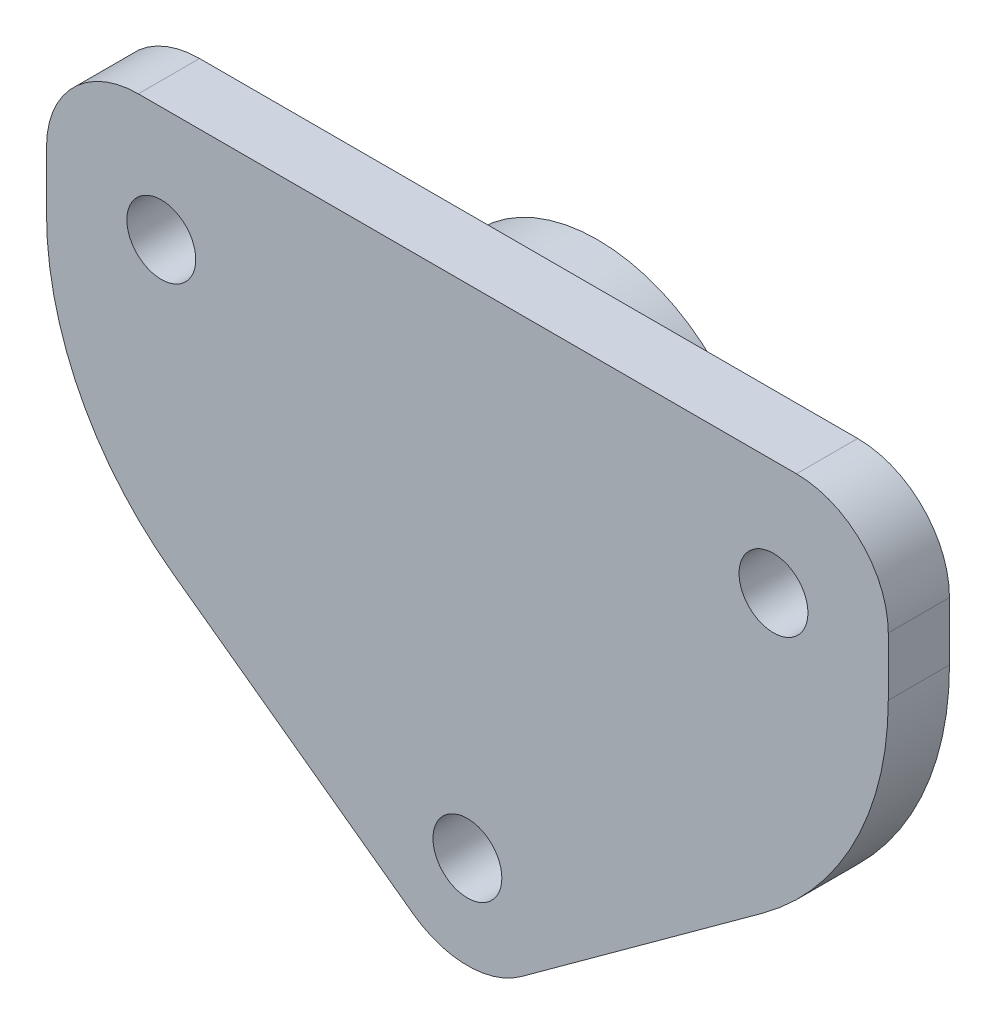
ISO-10303-21;
HEADER;
FILE_DESCRIPTION(('STEP AP214'),'2;1');
FILE_NAME('part.step','',(''),(''),'','','');
FILE_SCHEMA(('AUTOMOTIVE_DESIGN { 1 0 10303 214 1 1 1 1 }'));
ENDSEC;
DATA;
#1=APPLICATION_CONTEXT('core data for automotive mechanical design processes');
#2=APPLICATION_PROTOCOL_DEFINITION('international standard','automotive_design',2000,#1);
#3=PRODUCT_CONTEXT('',#1,'mechanical');
#4=PRODUCT('Part','Part','',(#3));
#5=PRODUCT_RELATED_PRODUCT_CATEGORY('part','',(#4));
#6=PRODUCT_DEFINITION_FORMATION('','',#4);
#7=PRODUCT_DEFINITION_CONTEXT('part definition',#1,'design');
#8=PRODUCT_DEFINITION('design','',#6,#7);
#9=PRODUCT_DEFINITION_SHAPE('','',#8);
#10=(LENGTH_UNIT() NAMED_UNIT(*) SI_UNIT(.MILLI.,.METRE.));
#11=(NAMED_UNIT(*) PLANE_ANGLE_UNIT() SI_UNIT($,.RADIAN.));
#12=(NAMED_UNIT(*) SI_UNIT($,.STERADIAN.) SOLID_ANGLE_UNIT());
#13=UNCERTAINTY_MEASURE_WITH_UNIT(LENGTH_MEASURE(1.E-05),#10,'distance_accuracy_value','');
#14=(GEOMETRIC_REPRESENTATION_CONTEXT(3) GLOBAL_UNCERTAINTY_ASSIGNED_CONTEXT((#13)) GLOBAL_UNIT_ASSIGNED_CONTEXT((#10,
#11,#12)) REPRESENTATION_CONTEXT('',''));
#15=CARTESIAN_POINT('',(0.,0.,0.));
#16=DIRECTION('',(0.,0.,1.));
#17=DIRECTION('',(1.,0.,0.));
#18=AXIS2_PLACEMENT_3D('',#15,#16,#17);
#19=CARTESIAN_POINT('',(0.,0.,4.));
#20=DIRECTION('',(0.,0.,1.));
#21=DIRECTION('',(1.,0.,0.));
#22=AXIS2_PLACEMENT_3D('',#19,#20,#21);
#23=PLANE('',#22);
#24=CARTESIAN_POINT('',(-7.5,32.5,4.));
#25=DIRECTION('',(0.,0.,1.));
#26=DIRECTION('',(1.,0.,0.));
#27=AXIS2_PLACEMENT_3D('',#24,#25,#26);
#28=CIRCLE('',#27,2.25);
#29=CARTESIAN_POINT('',(-5.25,32.5,4.));
#30=VERTEX_POINT('',#29);
#31=EDGE_CURVE('E215',#30,#30,#28,.T.);
#32=ORIENTED_EDGE('',*,*,#31,.F.);
#33=EDGE_LOOP('',(#32));
#34=FACE_BOUND('',#33,.T.);
#35=DIRECTION('',(0.,-1.,0.));
#36=VECTOR('',#35,1.);
#37=CARTESIAN_POINT('',(-55.,40.,4.));
#38=LINE('',#37,#36);
#39=CARTESIAN_POINT('',(-55.,34.,4.));
#40=VERTEX_POINT('',#39);
#41=CARTESIAN_POINT('',(-55.,30.1844918340644,4.));
#42=VERTEX_POINT('',#41);
#43=EDGE_CURVE('E145',#40,#42,#38,.T.);
#44=ORIENTED_EDGE('',*,*,#43,.T.);
#45=CARTESIAN_POINT('',(-35.,30.1844918340644,4.));
#46=DIRECTION('',(0.,0.,1.));
#47=DIRECTION('',(1.,0.,0.));
#48=AXIS2_PLACEMENT_3D('',#45,#46,#47);
#49=CIRCLE('',#48,20.);
#50=CARTESIAN_POINT('',(-46.7634339535009,14.0097701480007,4.));
#51=VERTEX_POINT('',#50);
#52=EDGE_CURVE('E177',#42,#51,#49,.T.);
#53=ORIENTED_EDGE('',*,*,#52,.T.);
#54=DIRECTION('',(0.808736084303188,-0.588171697675046,0.));
#55=VECTOR('',#54,1.);
#56=CARTESIAN_POINT('',(-55.,20.,4.));
#57=LINE('',#56,#55);
#58=CARTESIAN_POINT('',(-31.0290301860503,2.56656740803657,4.));
#59=VERTEX_POINT('',#58);
#60=EDGE_CURVE('E222',#51,#59,#57,.T.);
#61=ORIENTED_EDGE('',*,*,#60,.T.);
#62=CARTESIAN_POINT('',(-27.5,7.4189839138557,4.));
#63=DIRECTION('',(0.,0.,1.));
#64=DIRECTION('',(1.,0.,0.));
#65=AXIS2_PLACEMENT_3D('',#62,#63,#64);
#66=CIRCLE('',#65,6.);
#67=CARTESIAN_POINT('',(-23.9709698139497,2.56656740803657,4.));
#68=VERTEX_POINT('',#67);
#69=EDGE_CURVE('E155',#59,#68,#66,.T.);
#70=ORIENTED_EDGE('',*,*,#69,.T.);
#71=DIRECTION('',(0.808736084303188,0.588171697675046,0.));
#72=VECTOR('',#71,1.);
#73=CARTESIAN_POINT('',(-27.5,0.,4.));
#74=LINE('',#73,#72);
#75=CARTESIAN_POINT('',(-8.23656604649908,14.0097701480007,4.));
#76=VERTEX_POINT('',#75);
#77=EDGE_CURVE('E127',#68,#76,#74,.T.);
#78=ORIENTED_EDGE('',*,*,#77,.T.);
#79=CARTESIAN_POINT('',(-20.,30.1844918340644,4.));
#80=DIRECTION('',(0.,0.,1.));
#81=DIRECTION('',(1.,0.,0.));
#82=AXIS2_PLACEMENT_3D('',#79,#80,#81);
#83=CIRCLE('',#82,20.);
#84=CARTESIAN_POINT('',(0.,30.1844918340644,4.));
#85=VERTEX_POINT('',#84);
#86=EDGE_CURVE('E49',#76,#85,#83,.T.);
#87=ORIENTED_EDGE('',*,*,#86,.T.);
#88=DIRECTION('',(0.,1.,0.));
#89=VECTOR('',#88,1.);
#90=CARTESIAN_POINT('',(0.,40.,4.));
#91=LINE('',#90,#89);
#92=CARTESIAN_POINT('',(0.,34.,4.));
#93=VERTEX_POINT('',#92);
#94=EDGE_CURVE('E185',#85,#93,#91,.T.);
#95=ORIENTED_EDGE('',*,*,#94,.T.);
#96=CARTESIAN_POINT('',(-6.,34.,4.));
#97=DIRECTION('',(0.,0.,1.));
#98=DIRECTION('',(1.,0.,0.));
#99=AXIS2_PLACEMENT_3D('',#96,#97,#98);
#100=CIRCLE('',#99,6.);
#101=CARTESIAN_POINT('',(-6.,40.,4.));
#102=VERTEX_POINT('',#101);
#103=EDGE_CURVE('E151',#93,#102,#100,.T.);
#104=ORIENTED_EDGE('',*,*,#103,.T.);
#105=DIRECTION('',(-1.,0.,0.));
#106=VECTOR('',#105,1.);
#107=CARTESIAN_POINT('',(-55.,40.,4.));
#108=LINE('',#107,#106);
#109=CARTESIAN_POINT('',(-49.,40.,4.));
#110=VERTEX_POINT('',#109);
#111=EDGE_CURVE('E129',#102,#110,#108,.T.);
#112=ORIENTED_EDGE('',*,*,#111,.T.);
#113=CARTESIAN_POINT('',(-49.,34.,4.));
#114=DIRECTION('',(0.,0.,1.));
#115=DIRECTION('',(1.,0.,0.));
#116=AXIS2_PLACEMENT_3D('',#113,#114,#115);
#117=CIRCLE('',#116,6.);
#118=EDGE_CURVE('E153',#110,#40,#117,.T.);
#119=ORIENTED_EDGE('',*,*,#118,.T.);
#120=EDGE_LOOP('',(#44,#53,#61,#70,#78,#87,#95,#104,#112,#119));
#121=FACE_BOUND('',#120,.T.);
#122=CARTESIAN_POINT('',(-47.5,32.5,4.));
#123=DIRECTION('',(0.,0.,1.));
#124=DIRECTION('',(1.,0.,0.));
#125=AXIS2_PLACEMENT_3D('',#122,#123,#124);
#126=CIRCLE('',#125,2.25);
#127=CARTESIAN_POINT('',(-45.25,32.5,4.));
#128=VERTEX_POINT('',#127);
#129=EDGE_CURVE('E205',#128,#128,#126,.T.);
#130=ORIENTED_EDGE('',*,*,#129,.F.);
#131=EDGE_LOOP('',(#130));
#132=FACE_BOUND('',#131,.T.);
#133=CARTESIAN_POINT('',(-27.5,7.5,4.));
#134=DIRECTION('',(0.,0.,1.));
#135=DIRECTION('',(1.,0.,0.));
#136=AXIS2_PLACEMENT_3D('',#133,#134,#135);
#137=CIRCLE('',#136,2.25);
#138=CARTESIAN_POINT('',(-25.25,7.5,4.));
#139=VERTEX_POINT('',#138);
#140=EDGE_CURVE('E336',#139,#139,#137,.T.);
#141=ORIENTED_EDGE('',*,*,#140,.F.);
#142=EDGE_LOOP('',(#141));
#143=FACE_BOUND('',#142,.T.);
#144=ADVANCED_FACE('F33',(#34,#121,#132,#143),#23,.T.);
#145=CARTESIAN_POINT('',(0.,0.,0.));
#146=DIRECTION('',(0.,0.,1.));
#147=DIRECTION('',(1.,0.,0.));
#148=AXIS2_PLACEMENT_3D('',#145,#146,#147);
#149=PLANE('',#148);
#150=CARTESIAN_POINT('',(-27.5,27.5,0.));
#151=DIRECTION('',(0.,0.,1.));
#152=DIRECTION('',(1.,0.,0.));
#153=AXIS2_PLACEMENT_3D('',#150,#151,#152);
#154=CIRCLE('',#153,10.75);
#155=CARTESIAN_POINT('',(-16.75,27.5,0.));
#156=VERTEX_POINT('',#155);
#157=EDGE_CURVE('E11',#156,#156,#154,.F.);
#158=ORIENTED_EDGE('',*,*,#157,.F.);
#159=EDGE_LOOP('',(#158));
#160=FACE_BOUND('',#159,.T.);
#161=DIRECTION('',(0.808736084303188,-0.588171697675046,0.));
#162=VECTOR('',#161,1.);
#163=CARTESIAN_POINT('',(-55.,20.,0.));
#164=LINE('',#163,#162);
#165=CARTESIAN_POINT('',(-46.7634339535009,14.0097701480007,0.));
#166=VERTEX_POINT('',#165);
#167=CARTESIAN_POINT('',(-31.0290301860503,2.56656740803657,0.));
#168=VERTEX_POINT('',#167);
#169=EDGE_CURVE('E136',#166,#168,#164,.T.);
#170=ORIENTED_EDGE('',*,*,#169,.F.);
#171=CARTESIAN_POINT('',(-35.,30.1844918340644,0.));
#172=DIRECTION('',(0.,0.,1.));
#173=DIRECTION('',(1.,0.,0.));
#174=AXIS2_PLACEMENT_3D('',#171,#172,#173);
#175=CIRCLE('',#174,20.);
#176=CARTESIAN_POINT('',(-55.,30.1844918340644,0.));
#177=VERTEX_POINT('',#176);
#178=EDGE_CURVE('E172',#166,#177,#175,.F.);
#179=ORIENTED_EDGE('',*,*,#178,.T.);
#180=DIRECTION('',(0.,-1.,0.));
#181=VECTOR('',#180,1.);
#182=CARTESIAN_POINT('',(-55.,40.,0.));
#183=LINE('',#182,#181);
#184=CARTESIAN_POINT('',(-55.,34.,0.));
#185=VERTEX_POINT('',#184);
#186=EDGE_CURVE('E140',#185,#177,#183,.T.);
#187=ORIENTED_EDGE('',*,*,#186,.F.);
#188=CARTESIAN_POINT('',(-49.,34.,0.));
#189=DIRECTION('',(0.,0.,1.));
#190=DIRECTION('',(1.,0.,0.));
#191=AXIS2_PLACEMENT_3D('',#188,#189,#190);
#192=CIRCLE('',#191,6.);
#193=CARTESIAN_POINT('',(-49.,40.,0.));
#194=VERTEX_POINT('',#193);
#195=EDGE_CURVE('E123',#185,#194,#192,.F.);
#196=ORIENTED_EDGE('',*,*,#195,.T.);
#197=DIRECTION('',(-1.,0.,0.));
#198=VECTOR('',#197,1.);
#199=CARTESIAN_POINT('',(-55.,40.,0.));
#200=LINE('',#199,#198);
#201=CARTESIAN_POINT('',(-6.,40.,0.));
#202=VERTEX_POINT('',#201);
#203=EDGE_CURVE('E138',#202,#194,#200,.T.);
#204=ORIENTED_EDGE('',*,*,#203,.F.);
#205=CARTESIAN_POINT('',(-6.,34.,0.));
#206=DIRECTION('',(0.,0.,1.));
#207=DIRECTION('',(1.,0.,0.));
#208=AXIS2_PLACEMENT_3D('',#205,#206,#207);
#209=CIRCLE('',#208,6.);
#210=CARTESIAN_POINT('',(0.,34.,0.));
#211=VERTEX_POINT('',#210);
#212=EDGE_CURVE('E128',#202,#211,#209,.F.);
#213=ORIENTED_EDGE('',*,*,#212,.T.);
#214=DIRECTION('',(0.,1.,0.));
#215=VECTOR('',#214,1.);
#216=CARTESIAN_POINT('',(0.,40.,0.));
#217=LINE('',#216,#215);
#218=CARTESIAN_POINT('',(0.,30.1844918340644,0.));
#219=VERTEX_POINT('',#218);
#220=EDGE_CURVE('E135',#219,#211,#217,.T.);
#221=ORIENTED_EDGE('',*,*,#220,.F.);
#222=CARTESIAN_POINT('',(-20.,30.1844918340644,0.));
#223=DIRECTION('',(0.,0.,1.));
#224=DIRECTION('',(1.,0.,0.));
#225=AXIS2_PLACEMENT_3D('',#222,#223,#224);
#226=CIRCLE('',#225,20.);
#227=CARTESIAN_POINT('',(-8.23656604649908,14.0097701480007,0.));
#228=VERTEX_POINT('',#227);
#229=EDGE_CURVE('E134',#219,#228,#226,.F.);
#230=ORIENTED_EDGE('',*,*,#229,.T.);
#231=DIRECTION('',(0.808736084303188,0.588171697675046,0.));
#232=VECTOR('',#231,1.);
#233=CARTESIAN_POINT('',(-27.5,0.,0.));
#234=LINE('',#233,#232);
#235=CARTESIAN_POINT('',(-23.9709698139497,2.56656740803657,0.));
#236=VERTEX_POINT('',#235);
#237=EDGE_CURVE('E126',#236,#228,#234,.T.);
#238=ORIENTED_EDGE('',*,*,#237,.F.);
#239=CARTESIAN_POINT('',(-27.5,7.4189839138557,0.));
#240=DIRECTION('',(0.,0.,1.));
#241=DIRECTION('',(1.,0.,0.));
#242=AXIS2_PLACEMENT_3D('',#239,#240,#241);
#243=CIRCLE('',#242,6.);
#244=EDGE_CURVE('E113',#236,#168,#243,.F.);
#245=ORIENTED_EDGE('',*,*,#244,.T.);
#246=EDGE_LOOP('',(#170,#179,#187,#196,#204,#213,#221,#230,#238,#245));
#247=FACE_BOUND('',#246,.T.);
#248=CARTESIAN_POINT('',(-47.5,32.5,0.));
#249=DIRECTION('',(0.,0.,1.));
#250=DIRECTION('',(1.,0.,0.));
#251=AXIS2_PLACEMENT_3D('',#248,#249,#250);
#252=CIRCLE('',#251,2.25);
#253=CARTESIAN_POINT('',(-45.25,32.5,0.));
#254=VERTEX_POINT('',#253);
#255=EDGE_CURVE('E210',#254,#254,#252,.T.);
#256=ORIENTED_EDGE('',*,*,#255,.T.);
#257=EDGE_LOOP('',(#256));
#258=FACE_BOUND('',#257,.T.);
#259=CARTESIAN_POINT('',(-7.5,32.5,0.));
#260=DIRECTION('',(0.,0.,1.));
#261=DIRECTION('',(1.,0.,0.));
#262=AXIS2_PLACEMENT_3D('',#259,#260,#261);
#263=CIRCLE('',#262,2.25);
#264=CARTESIAN_POINT('',(-5.25,32.5,0.));
#265=VERTEX_POINT('',#264);
#266=EDGE_CURVE('E218',#265,#265,#263,.T.);
#267=ORIENTED_EDGE('',*,*,#266,.T.);
#268=EDGE_LOOP('',(#267));
#269=FACE_BOUND('',#268,.T.);
#270=CARTESIAN_POINT('',(-27.5,7.5,0.));
#271=DIRECTION('',(0.,0.,1.));
#272=DIRECTION('',(1.,0.,0.));
#273=AXIS2_PLACEMENT_3D('',#270,#271,#272);
#274=CIRCLE('',#273,2.25);
#275=CARTESIAN_POINT('',(-25.25,7.5,0.));
#276=VERTEX_POINT('',#275);
#277=EDGE_CURVE('E338',#276,#276,#274,.T.);
#278=ORIENTED_EDGE('',*,*,#277,.T.);
#279=EDGE_LOOP('',(#278));
#280=FACE_BOUND('',#279,.T.);
#281=ADVANCED_FACE('F131',(#160,#247,#258,#269,#280),#149,.F.);
#282=CARTESIAN_POINT('',(-55.,40.,4.));
#283=DIRECTION('',(1.,0.,0.));
#284=DIRECTION('',(0.,1.,0.));
#285=AXIS2_PLACEMENT_3D('',#282,#283,#284);
#286=PLANE('',#285);
#287=ORIENTED_EDGE('',*,*,#186,.T.);
#288=DIRECTION('',(0.,0.,-1.));
#289=VECTOR('',#288,1.);
#290=CARTESIAN_POINT('',(-55.,30.1844918340644,4.));
#291=LINE('',#290,#289);
#292=EDGE_CURVE('E174',#177,#42,#291,.F.);
#293=ORIENTED_EDGE('',*,*,#292,.T.);
#294=ORIENTED_EDGE('',*,*,#43,.F.);
#295=DIRECTION('',(0.,0.,-1.));
#296=VECTOR('',#295,1.);
#297=CARTESIAN_POINT('',(-55.,34.,4.));
#298=LINE('',#297,#296);
#299=EDGE_CURVE('E157',#40,#185,#298,.T.);
#300=ORIENTED_EDGE('',*,*,#299,.T.);
#301=EDGE_LOOP('',(#287,#293,#294,#300));
#302=FACE_BOUND('',#301,.T.);
#303=ADVANCED_FACE('F240',(#302),#286,.F.);
#304=CARTESIAN_POINT('',(-55.,20.,4.));
#305=DIRECTION('',(0.588171697675046,0.808736084303189,0.));
#306=DIRECTION('',(-0.808736084303189,0.588171697675046,0.));
#307=AXIS2_PLACEMENT_3D('',#304,#305,#306);
#308=PLANE('',#307);
#309=ORIENTED_EDGE('',*,*,#60,.F.);
#310=DIRECTION('',(0.,0.,-1.));
#311=VECTOR('',#310,1.);
#312=CARTESIAN_POINT('',(-46.7634339535009,14.0097701480007,4.));
#313=LINE('',#312,#311);
#314=EDGE_CURVE('E168',#51,#166,#313,.T.);
#315=ORIENTED_EDGE('',*,*,#314,.T.);
#316=ORIENTED_EDGE('',*,*,#169,.T.);
#317=DIRECTION('',(0.,0.,-1.));
#318=VECTOR('',#317,1.);
#319=CARTESIAN_POINT('',(-31.0290301860503,2.56656740803657,4.));
#320=LINE('',#319,#318);
#321=EDGE_CURVE('E119',#168,#59,#320,.F.);
#322=ORIENTED_EDGE('',*,*,#321,.T.);
#323=EDGE_LOOP('',(#309,#315,#316,#322));
#324=FACE_BOUND('',#323,.T.);
#325=ADVANCED_FACE('F254',(#324),#308,.F.);
#326=CARTESIAN_POINT('',(-27.5,0.,4.));
#327=DIRECTION('',(-0.588171697675046,0.808736084303189,0.));
#328=DIRECTION('',(-0.808736084303189,-0.588171697675046,0.));
#329=AXIS2_PLACEMENT_3D('',#326,#327,#328);
#330=PLANE('',#329);
#331=ORIENTED_EDGE('',*,*,#237,.T.);
#332=DIRECTION('',(0.,0.,-1.));
#333=VECTOR('',#332,1.);
#334=CARTESIAN_POINT('',(-8.23656604649908,14.0097701480007,4.));
#335=LINE('',#334,#333);
#336=EDGE_CURVE('E42',#228,#76,#335,.F.);
#337=ORIENTED_EDGE('',*,*,#336,.T.);
#338=ORIENTED_EDGE('',*,*,#77,.F.);
#339=DIRECTION('',(0.,0.,-1.));
#340=VECTOR('',#339,1.);
#341=CARTESIAN_POINT('',(-23.9709698139497,2.56656740803657,4.));
#342=LINE('',#341,#340);
#343=EDGE_CURVE('E117',#68,#236,#342,.T.);
#344=ORIENTED_EDGE('',*,*,#343,.T.);
#345=EDGE_LOOP('',(#331,#337,#338,#344));
#346=FACE_BOUND('',#345,.T.);
#347=ADVANCED_FACE('F125',(#346),#330,.F.);
#348=CARTESIAN_POINT('',(0.,40.,4.));
#349=DIRECTION('',(-1.,0.,0.));
#350=DIRECTION('',(0.,0.,1.));
#351=AXIS2_PLACEMENT_3D('',#348,#349,#350);
#352=PLANE('',#351);
#353=ORIENTED_EDGE('',*,*,#94,.F.);
#354=DIRECTION('',(0.,0.,-1.));
#355=VECTOR('',#354,1.);
#356=CARTESIAN_POINT('',(0.,30.1844918340644,4.));
#357=LINE('',#356,#355);
#358=EDGE_CURVE('E179',#85,#219,#357,.T.);
#359=ORIENTED_EDGE('',*,*,#358,.T.);
#360=ORIENTED_EDGE('',*,*,#220,.T.);
#361=DIRECTION('',(0.,0.,-1.));
#362=VECTOR('',#361,1.);
#363=CARTESIAN_POINT('',(0.,34.,4.));
#364=LINE('',#363,#362);
#365=EDGE_CURVE('E165',#211,#93,#364,.F.);
#366=ORIENTED_EDGE('',*,*,#365,.T.);
#367=EDGE_LOOP('',(#353,#359,#360,#366));
#368=FACE_BOUND('',#367,.T.);
#369=ADVANCED_FACE('F184',(#368),#352,.F.);
#370=CARTESIAN_POINT('',(-55.,40.,4.));
#371=DIRECTION('',(0.,-1.,0.));
#372=DIRECTION('',(0.,0.,-1.));
#373=AXIS2_PLACEMENT_3D('',#370,#371,#372);
#374=PLANE('',#373);
#375=ORIENTED_EDGE('',*,*,#203,.T.);
#376=DIRECTION('',(0.,0.,-1.));
#377=VECTOR('',#376,1.);
#378=CARTESIAN_POINT('',(-49.,40.,4.));
#379=LINE('',#378,#377);
#380=EDGE_CURVE('E163',#194,#110,#379,.F.);
#381=ORIENTED_EDGE('',*,*,#380,.T.);
#382=ORIENTED_EDGE('',*,*,#111,.F.);
#383=DIRECTION('',(0.,0.,-1.));
#384=VECTOR('',#383,1.);
#385=CARTESIAN_POINT('',(-6.,40.,4.));
#386=LINE('',#385,#384);
#387=EDGE_CURVE('E160',#102,#202,#386,.T.);
#388=ORIENTED_EDGE('',*,*,#387,.T.);
#389=EDGE_LOOP('',(#375,#381,#382,#388));
#390=FACE_BOUND('',#389,.T.);
#391=ADVANCED_FACE('F199',(#390),#374,.F.);
#392=CARTESIAN_POINT('',(-47.5,32.5,4.));
#393=DIRECTION('',(0.,0.,-1.));
#394=DIRECTION('',(-1.,0.,0.));
#395=AXIS2_PLACEMENT_3D('',#392,#393,#394);
#396=CYLINDRICAL_SURFACE('',#395,2.25);
#397=ORIENTED_EDGE('',*,*,#129,.T.);
#398=EDGE_LOOP('',(#397));
#399=FACE_BOUND('',#398,.T.);
#400=ORIENTED_EDGE('',*,*,#255,.F.);
#401=EDGE_LOOP('',(#400));
#402=FACE_BOUND('',#401,.T.);
#403=ADVANCED_FACE('F245',(#399,#402),#396,.F.);
#404=CARTESIAN_POINT('',(-7.5,32.5,4.));
#405=DIRECTION('',(0.,0.,-1.));
#406=DIRECTION('',(-1.,0.,0.));
#407=AXIS2_PLACEMENT_3D('',#404,#405,#406);
#408=CYLINDRICAL_SURFACE('',#407,2.25);
#409=ORIENTED_EDGE('',*,*,#31,.T.);
#410=EDGE_LOOP('',(#409));
#411=FACE_BOUND('',#410,.T.);
#412=ORIENTED_EDGE('',*,*,#266,.F.);
#413=EDGE_LOOP('',(#412));
#414=FACE_BOUND('',#413,.T.);
#415=ADVANCED_FACE('F324',(#411,#414),#408,.F.);
#416=CARTESIAN_POINT('',(-27.5,7.5,4.));
#417=DIRECTION('',(0.,0.,-1.));
#418=DIRECTION('',(-1.,0.,0.));
#419=AXIS2_PLACEMENT_3D('',#416,#417,#418);
#420=CYLINDRICAL_SURFACE('',#419,2.25);
#421=ORIENTED_EDGE('',*,*,#140,.T.);
#422=EDGE_LOOP('',(#421));
#423=FACE_BOUND('',#422,.T.);
#424=ORIENTED_EDGE('',*,*,#277,.F.);
#425=EDGE_LOOP('',(#424));
#426=FACE_BOUND('',#425,.T.);
#427=ADVANCED_FACE('F263',(#423,#426),#420,.F.);
#428=CARTESIAN_POINT('',(-27.5,7.4189839138557,4.));
#429=DIRECTION('',(0.,0.,-1.));
#430=DIRECTION('',(-1.,0.,0.));
#431=AXIS2_PLACEMENT_3D('',#428,#429,#430);
#432=CYLINDRICAL_SURFACE('',#431,6.);
#433=ORIENTED_EDGE('',*,*,#69,.F.);
#434=ORIENTED_EDGE('',*,*,#321,.F.);
#435=ORIENTED_EDGE('',*,*,#244,.F.);
#436=ORIENTED_EDGE('',*,*,#343,.F.);
#437=EDGE_LOOP('',(#433,#434,#435,#436));
#438=FACE_BOUND('',#437,.T.);
#439=ADVANCED_FACE('F116',(#438),#432,.T.);
#440=CARTESIAN_POINT('',(-49.,34.,4.));
#441=DIRECTION('',(0.,0.,-1.));
#442=DIRECTION('',(-1.,0.,0.));
#443=AXIS2_PLACEMENT_3D('',#440,#441,#442);
#444=CYLINDRICAL_SURFACE('',#443,6.);
#445=ORIENTED_EDGE('',*,*,#118,.F.);
#446=ORIENTED_EDGE('',*,*,#380,.F.);
#447=ORIENTED_EDGE('',*,*,#195,.F.);
#448=ORIENTED_EDGE('',*,*,#299,.F.);
#449=EDGE_LOOP('',(#445,#446,#447,#448));
#450=FACE_BOUND('',#449,.T.);
#451=ADVANCED_FACE('F262',(#450),#444,.T.);
#452=CARTESIAN_POINT('',(-6.,34.,4.));
#453=DIRECTION('',(0.,0.,-1.));
#454=DIRECTION('',(-1.,0.,0.));
#455=AXIS2_PLACEMENT_3D('',#452,#453,#454);
#456=CYLINDRICAL_SURFACE('',#455,6.);
#457=ORIENTED_EDGE('',*,*,#103,.F.);
#458=ORIENTED_EDGE('',*,*,#365,.F.);
#459=ORIENTED_EDGE('',*,*,#212,.F.);
#460=ORIENTED_EDGE('',*,*,#387,.F.);
#461=EDGE_LOOP('',(#457,#458,#459,#460));
#462=FACE_BOUND('',#461,.T.);
#463=ADVANCED_FACE('F192',(#462),#456,.T.);
#464=CARTESIAN_POINT('',(-35.,30.1844918340644,4.));
#465=DIRECTION('',(0.,0.,-1.));
#466=DIRECTION('',(-1.,0.,0.));
#467=AXIS2_PLACEMENT_3D('',#464,#465,#466);
#468=CYLINDRICAL_SURFACE('',#467,20.);
#469=ORIENTED_EDGE('',*,*,#52,.F.);
#470=ORIENTED_EDGE('',*,*,#292,.F.);
#471=ORIENTED_EDGE('',*,*,#178,.F.);
#472=ORIENTED_EDGE('',*,*,#314,.F.);
#473=EDGE_LOOP('',(#469,#470,#471,#472));
#474=FACE_BOUND('',#473,.T.);
#475=ADVANCED_FACE('F225',(#474),#468,.T.);
#476=CARTESIAN_POINT('',(-20.,30.1844918340644,4.));
#477=DIRECTION('',(0.,0.,-1.));
#478=DIRECTION('',(-1.,0.,0.));
#479=AXIS2_PLACEMENT_3D('',#476,#477,#478);
#480=CYLINDRICAL_SURFACE('',#479,20.);
#481=ORIENTED_EDGE('',*,*,#86,.F.);
#482=ORIENTED_EDGE('',*,*,#336,.F.);
#483=ORIENTED_EDGE('',*,*,#229,.F.);
#484=ORIENTED_EDGE('',*,*,#358,.F.);
#485=EDGE_LOOP('',(#481,#482,#483,#484));
#486=FACE_BOUND('',#485,.T.);
#487=ADVANCED_FACE('F35',(#486),#480,.T.);
#488=CARTESIAN_POINT('',(-27.5,27.5,-4.5));
#489=DIRECTION('',(0.,0.,1.));
#490=DIRECTION('',(1.,0.,0.));
#491=AXIS2_PLACEMENT_3D('',#488,#489,#490);
#492=CYLINDRICAL_SURFACE('',#491,10.75);
#493=CARTESIAN_POINT('',(-27.5,27.5,-4.5));
#494=DIRECTION('',(0.,0.,-1.));
#495=DIRECTION('',(-1.,0.,0.));
#496=AXIS2_PLACEMENT_3D('',#493,#494,#495);
#497=CIRCLE('',#496,10.75);
#498=CARTESIAN_POINT('',(-38.25,27.5,-4.5));
#499=VERTEX_POINT('',#498);
#500=EDGE_CURVE('E342',#499,#499,#497,.T.);
#501=ORIENTED_EDGE('',*,*,#500,.F.);
#502=EDGE_LOOP('',(#501));
#503=FACE_BOUND('',#502,.T.);
#504=ORIENTED_EDGE('',*,*,#157,.T.);
#505=EDGE_LOOP('',(#504));
#506=FACE_BOUND('',#505,.T.);
#507=ADVANCED_FACE('F224',(#503,#506),#492,.T.);
#508=CARTESIAN_POINT('',(-27.5,27.5,-4.5));
#509=DIRECTION('',(0.,0.,-1.));
#510=DIRECTION('',(-1.,0.,0.));
#511=AXIS2_PLACEMENT_3D('',#508,#509,#510);
#512=PLANE('',#511);
#513=CARTESIAN_POINT('',(-27.5,27.5,-4.5));
#514=DIRECTION('',(0.,0.,-1.));
#515=DIRECTION('',(-1.,0.,0.));
#516=AXIS2_PLACEMENT_3D('',#513,#514,#515);
#517=CIRCLE('',#516,2.75);
#518=CARTESIAN_POINT('',(-30.25,27.5,-4.5));
#519=VERTEX_POINT('',#518);
#520=EDGE_CURVE('E37',#519,#519,#517,.T.);
#521=ORIENTED_EDGE('',*,*,#520,.F.);
#522=EDGE_LOOP('',(#521));
#523=FACE_BOUND('',#522,.T.);
#524=ORIENTED_EDGE('',*,*,#500,.T.);
#525=EDGE_LOOP('',(#524));
#526=FACE_BOUND('',#525,.T.);
#527=ADVANCED_FACE('F230',(#523,#526),#512,.T.);
#528=CARTESIAN_POINT('',(-27.5,27.5,-4.5));
#529=DIRECTION('',(0.,1.,0.));
#530=DIRECTION('',(-1.,0.,0.));
#531=AXIS2_PLACEMENT_3D('',#528,#529,#530);
#532=SPHERICAL_SURFACE('',#531,2.75);
#533=CARTESIAN_POINT('',(-27.5,27.5,-4.5));
#534=DIRECTION('',(0.,0.,-1.));
#535=DIRECTION('',(-1.,0.,0.));
#536=AXIS2_PLACEMENT_3D('',#533,#534,#535);
#537=SPHERICAL_SURFACE('',#536,2.75);
#538=ORIENTED_EDGE('',*,*,#520,.T.);
#539=EDGE_LOOP('',(#538));
#540=FACE_BOUND('',#539,.T.);
#541=ADVANCED_FACE('F307',(#540),#537,.F.);
#542=CLOSED_SHELL('',(#144,#281,#303,#325,#347,#369,#391,#403,#415,#427,#439,#451,#463,#475,
#487,#507,#527,#541));
#543=MANIFOLD_SOLID_BREP('B2',#542);
#544=ADVANCED_BREP_SHAPE_REPRESENTATION('',(#18,#543),#14);
#545=SHAPE_DEFINITION_REPRESENTATION(#9,#544);
ENDSEC;
END-ISO-10303-21;
